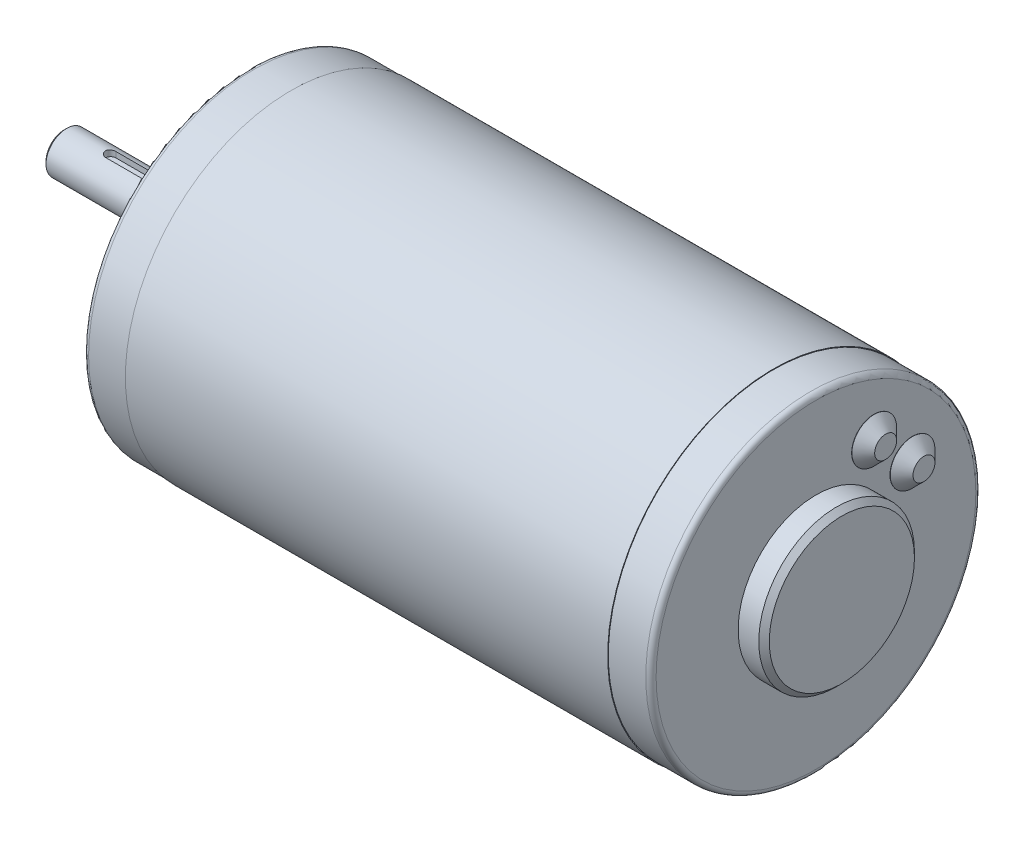
ISO-10303-21;
HEADER;
FILE_DESCRIPTION(('STEP AP214'),'2;1');
FILE_NAME('part.step','',(''),(''),'','','');
FILE_SCHEMA(('AUTOMOTIVE_DESIGN { 1 0 10303 214 1 1 1 1 }'));
ENDSEC;
DATA;
#1=APPLICATION_CONTEXT('core data for automotive mechanical design processes');
#2=APPLICATION_PROTOCOL_DEFINITION('international standard','automotive_design',2000,#1);
#3=PRODUCT_CONTEXT('',#1,'mechanical');
#4=PRODUCT('Part','Part','',(#3));
#5=PRODUCT_RELATED_PRODUCT_CATEGORY('part','',(#4));
#6=PRODUCT_DEFINITION_FORMATION('','',#4);
#7=PRODUCT_DEFINITION_CONTEXT('part definition',#1,'design');
#8=PRODUCT_DEFINITION('design','',#6,#7);
#9=PRODUCT_DEFINITION_SHAPE('','',#8);
#10=(LENGTH_UNIT() NAMED_UNIT(*) SI_UNIT(.MILLI.,.METRE.));
#11=(NAMED_UNIT(*) PLANE_ANGLE_UNIT() SI_UNIT($,.RADIAN.));
#12=(NAMED_UNIT(*) SI_UNIT($,.STERADIAN.) SOLID_ANGLE_UNIT());
#13=UNCERTAINTY_MEASURE_WITH_UNIT(LENGTH_MEASURE(1.E-05),#10,'distance_accuracy_value','');
#14=(GEOMETRIC_REPRESENTATION_CONTEXT(3) GLOBAL_UNCERTAINTY_ASSIGNED_CONTEXT((#13)) GLOBAL_UNIT_ASSIGNED_CONTEXT((#10,
#11,#12)) REPRESENTATION_CONTEXT('',''));
#15=CARTESIAN_POINT('',(0.,0.,0.));
#16=DIRECTION('',(0.,0.,1.));
#17=DIRECTION('',(1.,0.,0.));
#18=AXIS2_PLACEMENT_3D('',#15,#16,#17);
#19=CARTESIAN_POINT('',(-4.,0.,0.));
#20=DIRECTION('',(-1.,0.,0.));
#21=DIRECTION('',(0.,0.,1.));
#22=AXIS2_PLACEMENT_3D('',#19,#20,#21);
#23=PLANE('',#22);
#24=CARTESIAN_POINT('',(-4.,0.,0.));
#25=DIRECTION('',(-1.,0.,0.));
#26=DIRECTION('',(0.,0.,1.));
#27=AXIS2_PLACEMENT_3D('',#24,#25,#26);
#28=CIRCLE('',#27,8.50900000000004);
#29=CARTESIAN_POINT('',(-4.,0.,8.50900000000004));
#30=VERTEX_POINT('',#29);
#31=EDGE_CURVE('E164',#30,#30,#28,.T.);
#32=ORIENTED_EDGE('',*,*,#31,.T.);
#33=EDGE_LOOP('',(#32));
#34=FACE_BOUND('',#33,.T.);
#35=CARTESIAN_POINT('',(-4.,0.,0.));
#36=DIRECTION('',(-1.,0.,0.));
#37=DIRECTION('',(0.,0.,1.));
#38=AXIS2_PLACEMENT_3D('',#35,#36,#37);
#39=CIRCLE('',#38,4.);
#40=CARTESIAN_POINT('',(-4.,0.,4.));
#41=VERTEX_POINT('',#40);
#42=EDGE_CURVE('E131',#41,#41,#39,.T.);
#43=ORIENTED_EDGE('',*,*,#42,.F.);
#44=EDGE_LOOP('',(#43));
#45=FACE_BOUND('',#44,.T.);
#46=ADVANCED_FACE('F34',(#34,#45),#23,.T.);
#47=CARTESIAN_POINT('',(0.,0.,0.));
#48=DIRECTION('',(-1.,0.,0.));
#49=DIRECTION('',(0.,0.,1.));
#50=AXIS2_PLACEMENT_3D('',#47,#48,#49);
#51=PLANE('',#50);
#52=CARTESIAN_POINT('',(0.,0.,0.));
#53=DIRECTION('',(-1.,0.,0.));
#54=DIRECTION('',(0.,0.,1.));
#55=AXIS2_PLACEMENT_3D('',#52,#53,#54);
#56=CIRCLE('',#55,30.877);
#57=CARTESIAN_POINT('',(0.,0.,30.877));
#58=VERTEX_POINT('',#57);
#59=EDGE_CURVE('E182',#58,#58,#56,.T.);
#60=ORIENTED_EDGE('',*,*,#59,.T.);
#61=EDGE_LOOP('',(#60));
#62=FACE_BOUND('',#61,.T.);
#63=CARTESIAN_POINT('',(0.,25.4,0.));
#64=DIRECTION('',(-1.,0.,0.));
#65=DIRECTION('',(0.,0.,1.));
#66=AXIS2_PLACEMENT_3D('',#63,#64,#65);
#67=CIRCLE('',#66,2.01929999999999);
#68=CARTESIAN_POINT('',(0.,25.4,2.01929999999999));
#69=VERTEX_POINT('',#68);
#70=EDGE_CURVE('E104',#69,#69,#67,.T.);
#71=ORIENTED_EDGE('',*,*,#70,.F.);
#72=EDGE_LOOP('',(#71));
#73=FACE_BOUND('',#72,.T.);
#74=CARTESIAN_POINT('',(0.,-25.4,0.));
#75=DIRECTION('',(-1.,0.,0.));
#76=DIRECTION('',(0.,0.,1.));
#77=AXIS2_PLACEMENT_3D('',#74,#75,#76);
#78=CIRCLE('',#77,2.01929999999999);
#79=CARTESIAN_POINT('',(0.,-25.4,2.01929999999999));
#80=VERTEX_POINT('',#79);
#81=EDGE_CURVE('E113',#80,#80,#78,.T.);
#82=ORIENTED_EDGE('',*,*,#81,.F.);
#83=EDGE_LOOP('',(#82));
#84=FACE_BOUND('',#83,.T.);
#85=CARTESIAN_POINT('',(0.,0.,0.));
#86=DIRECTION('',(-1.,0.,0.));
#87=DIRECTION('',(0.,0.,1.));
#88=AXIS2_PLACEMENT_3D('',#85,#86,#87);
#89=CIRCLE('',#88,9.525);
#90=CARTESIAN_POINT('',(0.,0.,9.525));
#91=VERTEX_POINT('',#90);
#92=EDGE_CURVE('E134',#91,#91,#89,.T.);
#93=ORIENTED_EDGE('',*,*,#92,.F.);
#94=EDGE_LOOP('',(#93));
#95=FACE_BOUND('',#94,.T.);
#96=ADVANCED_FACE('F256',(#62,#73,#84,#95),#51,.T.);
#97=CARTESIAN_POINT('',(8.2296,32.004,0.));
#98=DIRECTION('',(-1.,0.,0.));
#99=DIRECTION('',(0.,0.,1.));
#100=AXIS2_PLACEMENT_3D('',#97,#98,#99);
#101=PLANE('',#100);
#102=CARTESIAN_POINT('',(8.2296,0.,0.));
#103=DIRECTION('',(1.,0.,0.));
#104=DIRECTION('',(0.,0.,-1.));
#105=AXIS2_PLACEMENT_3D('',#102,#103,#104);
#106=CIRCLE('',#105,32.004);
#107=CARTESIAN_POINT('',(8.2296,0.,-32.004));
#108=VERTEX_POINT('',#107);
#109=EDGE_CURVE('E155',#108,#108,#106,.T.);
#110=ORIENTED_EDGE('',*,*,#109,.F.);
#111=EDGE_LOOP('',(#110));
#112=FACE_BOUND('',#111,.T.);
#113=CARTESIAN_POINT('',(8.2296,0.,0.));
#114=DIRECTION('',(-1.,0.,0.));
#115=DIRECTION('',(0.,0.,1.));
#116=AXIS2_PLACEMENT_3D('',#113,#114,#115);
#117=CIRCLE('',#116,31.877);
#118=CARTESIAN_POINT('',(8.2296,0.,31.877));
#119=VERTEX_POINT('',#118);
#120=EDGE_CURVE('E137',#119,#119,#117,.T.);
#121=ORIENTED_EDGE('',*,*,#120,.F.);
#122=EDGE_LOOP('',(#121));
#123=FACE_BOUND('',#122,.T.);
#124=ADVANCED_FACE('F261',(#112,#123),#101,.T.);
#125=CARTESIAN_POINT('',(109.6,0.,0.));
#126=DIRECTION('',(1.,0.,0.));
#127=DIRECTION('',(0.,0.,-1.));
#128=AXIS2_PLACEMENT_3D('',#125,#126,#127);
#129=PLANE('',#128);
#130=CARTESIAN_POINT('',(109.6,0.,0.));
#131=DIRECTION('',(1.,0.,0.));
#132=DIRECTION('',(0.,0.,-1.));
#133=AXIS2_PLACEMENT_3D('',#130,#131,#132);
#134=CIRCLE('',#133,30.877);
#135=CARTESIAN_POINT('',(109.6,0.,-30.877));
#136=VERTEX_POINT('',#135);
#137=EDGE_CURVE('E176',#136,#136,#134,.T.);
#138=ORIENTED_EDGE('',*,*,#137,.T.);
#139=EDGE_LOOP('',(#138));
#140=FACE_BOUND('',#139,.T.);
#141=CARTESIAN_POINT('',(109.6,18.6070906828553,-11.2073596390943));
#142=DIRECTION('',(1.,0.,0.));
#143=DIRECTION('',(0.,0.,-1.));
#144=AXIS2_PLACEMENT_3D('',#141,#142,#143);
#145=CIRCLE('',#144,4.318);
#146=CARTESIAN_POINT('',(109.6,18.6070906828553,-15.5253596390943));
#147=VERTEX_POINT('',#146);
#148=EDGE_CURVE('E161',#147,#147,#145,.T.);
#149=ORIENTED_EDGE('',*,*,#148,.F.);
#150=EDGE_LOOP('',(#149));
#151=FACE_BOUND('',#150,.T.);
#152=CARTESIAN_POINT('',(109.6,11.2073596390943,-18.6070906828553));
#153=DIRECTION('',(1.,0.,0.));
#154=DIRECTION('',(0.,0.,-1.));
#155=AXIS2_PLACEMENT_3D('',#152,#153,#154);
#156=CIRCLE('',#155,4.318);
#157=CARTESIAN_POINT('',(109.6,11.2073596390943,-22.9250906828553));
#158=VERTEX_POINT('',#157);
#159=EDGE_CURVE('E158',#158,#158,#156,.T.);
#160=ORIENTED_EDGE('',*,*,#159,.F.);
#161=EDGE_LOOP('',(#160));
#162=FACE_BOUND('',#161,.T.);
#163=CARTESIAN_POINT('',(109.6,0.,0.));
#164=DIRECTION('',(1.,0.,0.));
#165=DIRECTION('',(0.,0.,-1.));
#166=AXIS2_PLACEMENT_3D('',#163,#164,#165);
#167=CIRCLE('',#166,15.0368);
#168=CARTESIAN_POINT('',(109.6,0.,-15.0368));
#169=VERTEX_POINT('',#168);
#170=EDGE_CURVE('E143',#169,#169,#167,.T.);
#171=ORIENTED_EDGE('',*,*,#170,.F.);
#172=EDGE_LOOP('',(#171));
#173=FACE_BOUND('',#172,.T.);
#174=ADVANCED_FACE('F286',(#140,#151,#162,#173),#129,.T.);
#175=CARTESIAN_POINT('',(101.3704,0.,0.));
#176=DIRECTION('',(1.,0.,0.));
#177=DIRECTION('',(0.,0.,-1.));
#178=AXIS2_PLACEMENT_3D('',#175,#176,#177);
#179=PLANE('',#178);
#180=CARTESIAN_POINT('',(101.3704,0.,0.));
#181=DIRECTION('',(1.,0.,0.));
#182=DIRECTION('',(0.,0.,-1.));
#183=AXIS2_PLACEMENT_3D('',#180,#181,#182);
#184=CIRCLE('',#183,32.004);
#185=CARTESIAN_POINT('',(101.3704,0.,-32.004));
#186=VERTEX_POINT('',#185);
#187=EDGE_CURVE('E152',#186,#186,#184,.T.);
#188=ORIENTED_EDGE('',*,*,#187,.T.);
#189=EDGE_LOOP('',(#188));
#190=FACE_BOUND('',#189,.T.);
#191=CARTESIAN_POINT('',(101.3704,0.,0.));
#192=DIRECTION('',(1.,0.,0.));
#193=DIRECTION('',(0.,0.,-1.));
#194=AXIS2_PLACEMENT_3D('',#191,#192,#193);
#195=CIRCLE('',#194,31.877);
#196=CARTESIAN_POINT('',(101.3704,0.,-31.877));
#197=VERTEX_POINT('',#196);
#198=EDGE_CURVE('E147',#197,#197,#195,.T.);
#199=ORIENTED_EDGE('',*,*,#198,.F.);
#200=EDGE_LOOP('',(#199));
#201=FACE_BOUND('',#200,.T.);
#202=ADVANCED_FACE('F289',(#190,#201),#179,.T.);
#203=CARTESIAN_POINT('',(8.2296,0.,0.));
#204=DIRECTION('',(1.,0.,0.));
#205=DIRECTION('',(0.,0.,-1.));
#206=AXIS2_PLACEMENT_3D('',#203,#204,#205);
#207=CYLINDRICAL_SURFACE('',#206,32.004);
#208=ORIENTED_EDGE('',*,*,#109,.T.);
#209=EDGE_LOOP('',(#208));
#210=FACE_BOUND('',#209,.T.);
#211=ORIENTED_EDGE('',*,*,#187,.F.);
#212=EDGE_LOOP('',(#211));
#213=FACE_BOUND('',#212,.T.);
#214=ADVANCED_FACE('F293',(#210,#213),#207,.T.);
#215=CARTESIAN_POINT('',(109.6,0.,0.));
#216=DIRECTION('',(-1.,0.,0.));
#217=DIRECTION('',(0.,0.,1.));
#218=AXIS2_PLACEMENT_3D('',#215,#216,#217);
#219=CYLINDRICAL_SURFACE('',#218,31.877);
#220=CARTESIAN_POINT('',(108.6,0.,0.));
#221=DIRECTION('',(1.,0.,0.));
#222=DIRECTION('',(0.,0.,-1.));
#223=AXIS2_PLACEMENT_3D('',#220,#221,#222);
#224=CIRCLE('',#223,31.877);
#225=CARTESIAN_POINT('',(108.6,0.,-31.877));
#226=VERTEX_POINT('',#225);
#227=EDGE_CURVE('E179',#226,#226,#224,.F.);
#228=ORIENTED_EDGE('',*,*,#227,.T.);
#229=EDGE_LOOP('',(#228));
#230=FACE_BOUND('',#229,.T.);
#231=ORIENTED_EDGE('',*,*,#198,.T.);
#232=EDGE_LOOP('',(#231));
#233=FACE_BOUND('',#232,.T.);
#234=ADVANCED_FACE('F284',(#230,#233),#219,.T.);
#235=CARTESIAN_POINT('',(113.584,0.,0.));
#236=DIRECTION('',(-1.,0.,0.));
#237=DIRECTION('',(0.,0.,1.));
#238=AXIS2_PLACEMENT_3D('',#235,#236,#237);
#239=CYLINDRICAL_SURFACE('',#238,15.0368);
#240=CARTESIAN_POINT('',(113.584,0.,0.));
#241=DIRECTION('',(1.,0.,0.));
#242=DIRECTION('',(0.,0.,-1.));
#243=AXIS2_PLACEMENT_3D('',#240,#241,#242);
#244=CIRCLE('',#243,15.0368);
#245=CARTESIAN_POINT('',(113.584,0.,-15.0368));
#246=VERTEX_POINT('',#245);
#247=EDGE_CURVE('E144',#246,#246,#244,.T.);
#248=ORIENTED_EDGE('',*,*,#247,.F.);
#249=EDGE_LOOP('',(#248));
#250=FACE_BOUND('',#249,.T.);
#251=ORIENTED_EDGE('',*,*,#170,.T.);
#252=EDGE_LOOP('',(#251));
#253=FACE_BOUND('',#252,.T.);
#254=ADVANCED_FACE('F280',(#250,#253),#239,.T.);
#255=CARTESIAN_POINT('',(113.584,0.,0.));
#256=DIRECTION('',(-1.,0.,0.));
#257=DIRECTION('',(0.,0.,-1.));
#258=AXIS2_PLACEMENT_3D('',#255,#256,#257);
#259=CONICAL_SURFACE('',#258,15.0368,0.785398163397437);
#260=CARTESIAN_POINT('',(114.6,0.,0.));
#261=DIRECTION('',(1.,0.,0.));
#262=DIRECTION('',(0.,0.,-1.));
#263=AXIS2_PLACEMENT_3D('',#260,#261,#262);
#264=CIRCLE('',#263,14.0208);
#265=CARTESIAN_POINT('',(114.6,0.,-14.0208));
#266=VERTEX_POINT('',#265);
#267=EDGE_CURVE('E140',#266,#266,#264,.T.);
#268=ORIENTED_EDGE('',*,*,#267,.F.);
#269=EDGE_LOOP('',(#268));
#270=FACE_BOUND('',#269,.T.);
#271=ORIENTED_EDGE('',*,*,#247,.T.);
#272=EDGE_LOOP('',(#271));
#273=FACE_BOUND('',#272,.T.);
#274=ADVANCED_FACE('F276',(#270,#273),#259,.T.);
#275=CARTESIAN_POINT('',(114.6,0.,0.));
#276=DIRECTION('',(1.,0.,0.));
#277=DIRECTION('',(0.,0.,-1.));
#278=AXIS2_PLACEMENT_3D('',#275,#276,#277);
#279=PLANE('',#278);
#280=ORIENTED_EDGE('',*,*,#267,.T.);
#281=EDGE_LOOP('',(#280));
#282=FACE_BOUND('',#281,.T.);
#283=ADVANCED_FACE('F272',(#282),#279,.T.);
#284=CARTESIAN_POINT('',(0.,0.,0.));
#285=DIRECTION('',(1.,0.,0.));
#286=DIRECTION('',(0.,0.,-1.));
#287=AXIS2_PLACEMENT_3D('',#284,#285,#286);
#288=CYLINDRICAL_SURFACE('',#287,31.877);
#289=CARTESIAN_POINT('',(0.999999999999998,0.,0.));
#290=DIRECTION('',(-1.,0.,0.));
#291=DIRECTION('',(0.,0.,1.));
#292=AXIS2_PLACEMENT_3D('',#289,#290,#291);
#293=CIRCLE('',#292,31.877);
#294=CARTESIAN_POINT('',(0.999999999999998,0.,31.877));
#295=VERTEX_POINT('',#294);
#296=EDGE_CURVE('E185',#295,#295,#293,.F.);
#297=ORIENTED_EDGE('',*,*,#296,.T.);
#298=EDGE_LOOP('',(#297));
#299=FACE_BOUND('',#298,.T.);
#300=ORIENTED_EDGE('',*,*,#120,.T.);
#301=EDGE_LOOP('',(#300));
#302=FACE_BOUND('',#301,.T.);
#303=ADVANCED_FACE('F267',(#299,#302),#288,.T.);
#304=CARTESIAN_POINT('',(-4.,0.,0.));
#305=DIRECTION('',(1.,0.,0.));
#306=DIRECTION('',(0.,0.,-1.));
#307=AXIS2_PLACEMENT_3D('',#304,#305,#306);
#308=CYLINDRICAL_SURFACE('',#307,9.525);
#309=CARTESIAN_POINT('',(-2.98400000000005,0.,0.));
#310=DIRECTION('',(-1.,0.,0.));
#311=DIRECTION('',(0.,0.,1.));
#312=AXIS2_PLACEMENT_3D('',#309,#310,#311);
#313=CIRCLE('',#312,9.525);
#314=CARTESIAN_POINT('',(-2.98400000000005,0.,9.525));
#315=VERTEX_POINT('',#314);
#316=EDGE_CURVE('E167',#315,#315,#313,.F.);
#317=ORIENTED_EDGE('',*,*,#316,.T.);
#318=EDGE_LOOP('',(#317));
#319=FACE_BOUND('',#318,.T.);
#320=ORIENTED_EDGE('',*,*,#92,.T.);
#321=EDGE_LOOP('',(#320));
#322=FACE_BOUND('',#321,.T.);
#323=ADVANCED_FACE('F253',(#319,#322),#308,.T.);
#324=CARTESIAN_POINT('',(-35.6,0.,0.));
#325=DIRECTION('',(1.,0.,0.));
#326=DIRECTION('',(0.,0.,-1.));
#327=AXIS2_PLACEMENT_3D('',#324,#325,#326);
#328=CYLINDRICAL_SURFACE('',#327,4.);
#329=CARTESIAN_POINT('',(-26.6,3.87298334620741,1.));
#330=CARTESIAN_POINT('',(-26.6276629851065,3.87298148580177,1.00000033749611));
#331=CARTESIAN_POINT('',(-26.6553122630182,3.8732800994947,0.998851407375366));
#332=CARTESIAN_POINT('',(-26.7104040353036,3.87445904774558,0.994271295395754));
#333=CARTESIAN_POINT('',(-26.7378465636871,3.87533928441687,0.990840497572679));
#334=CARTESIAN_POINT('',(-26.8194531732088,3.87881710972053,0.977175239382526));
#335=CARTESIAN_POINT('',(-26.8730564684822,3.88225203148808,0.963567695172493));
#336=CARTESIAN_POINT('',(-26.977124673782,3.89095422588002,0.927798076247996));
#337=CARTESIAN_POINT('',(-27.0275898782129,3.89622132630929,0.905636805423834));
#338=CARTESIAN_POINT('',(-27.1241114486473,3.90799134471939,0.853415378025864));
#339=CARTESIAN_POINT('',(-27.170166627891,3.91449459395647,0.823353103356932));
#340=CARTESIAN_POINT('',(-27.2575438819061,3.92816262398025,0.755484471828068));
#341=CARTESIAN_POINT('',(-27.2987548862455,3.93533791028915,0.717537268783974));
#342=CARTESIAN_POINT('',(-27.3743020894827,3.94945104396193,0.635275780516227));
#343=CARTESIAN_POINT('',(-27.4086371894679,3.95638885322537,0.590960479478829));
#344=CARTESIAN_POINT('',(-27.4699110016186,3.96936182283248,0.496456899401689));
#345=CARTESIAN_POINT('',(-27.496739895984,3.9753830468173,0.446195340334472));
#346=CARTESIAN_POINT('',(-27.5415247341967,3.98572346250588,0.341702590842918));
#347=CARTESIAN_POINT('',(-27.5594824242998,3.990042989147,0.28747218408301));
#348=CARTESIAN_POINT('',(-27.5856589927774,3.99641900005128,0.177744108525161));
#349=CARTESIAN_POINT('',(-27.5940676724228,3.998519529013,0.122294322002858));
#350=CARTESIAN_POINT('',(-27.6015033715433,4.00037438150815,0.010732775681679));
#351=CARTESIAN_POINT('',(-27.6005315701923,4.00012899993444,-0.0453789000287063));
#352=CARTESIAN_POINT('',(-27.5893700363146,3.99735237365735,-0.155352492972097));
#353=CARTESIAN_POINT('',(-27.5793853834005,3.9948719867736,-0.209236701739855));
#354=CARTESIAN_POINT('',(-27.5508113208173,3.98796330636495,-0.31453871108434));
#355=CARTESIAN_POINT('',(-27.5322215304314,3.98353492665556,-0.365956402423988));
#356=CARTESIAN_POINT('',(-27.4867987193294,3.97314997761798,-0.465407286024539));
#357=CARTESIAN_POINT('',(-27.4598926057672,3.96717993827555,-0.513405629602248));
#358=CARTESIAN_POINT('',(-27.3986568701665,3.95435945541919,-0.604276631230014));
#359=CARTESIAN_POINT('',(-27.3643261297468,3.94750887933198,-0.64714851556229));
#360=CARTESIAN_POINT('',(-27.2881210879187,3.93345566022865,-0.727769389708491));
#361=CARTESIAN_POINT('',(-27.2460683634602,3.92624850477685,-0.765349103054127));
#362=CARTESIAN_POINT('',(-27.1561701330723,3.91246168284006,-0.832969575186237));
#363=CARTESIAN_POINT('',(-27.1083230467164,3.90588218842993,-0.863008270245061));
#364=CARTESIAN_POINT('',(-27.0078544021762,3.89407813586325,-0.914804709285961));
#365=CARTESIAN_POINT('',(-26.9552085351039,3.88886106009136,-0.936517017887268));
#366=CARTESIAN_POINT('',(-26.8468830715817,3.88047058807054,-0.970702351849828));
#367=CARTESIAN_POINT('',(-26.7912081448502,3.87729413761435,-0.983189189212131));
#368=CARTESIAN_POINT('',(-26.7125426192411,3.87455290681524,-0.993904635150938));
#369=CARTESIAN_POINT('',(-26.6900802967868,3.87396523110859,-0.996190790966708));
#370=CARTESIAN_POINT('',(-26.6450822100907,3.87318062488974,-0.999236757697393));
#371=CARTESIAN_POINT('',(-26.6225466240447,3.87298306219461,-0.999999038096045));
#372=CARTESIAN_POINT('',(-26.6,3.87298334620741,-1.));
#373=B_SPLINE_CURVE_WITH_KNOTS('',3,(#329,#330,#331,#332,#333,#334,#335,#336,#337,#338,#339,
#340,#341,#342,#343,#344,#345,#346,#347,#348,#349,#350,#351,#352,#353,#354,#355,#356,#357,#358,
#359,#360,#361,#362,#363,#364,#365,#366,#367,#368,#369,#370,#371,#372),.UNSPECIFIED.,.F.,.F.,(4,
2,2,2,2,2,2,2,2,2,2,2,2,2,2,2,2,2,2,2,2,4),(0.,0.0829365303397727,0.165859106084653,
0.331229963080318,0.496585282091499,0.661984974726751,0.830641897427977,0.999325753539196,
1.17036187098235,1.34136430732424,1.50890481515325,1.67642426256639,1.84022545479276,
2.00403389475838,2.16932509450376,2.33464120964329,2.50441429534542,2.67423379180967,
2.84496720161067,3.01544447539986,3.08315848722648,3.15076267731671),.UNSPECIFIED.);
#374=CARTESIAN_POINT('',(-26.6,3.87298334620741,1.));
#375=VERTEX_POINT('',#374);
#376=CARTESIAN_POINT('',(-26.6,3.87298334620741,-1.));
#377=VERTEX_POINT('',#376);
#378=EDGE_CURVE('E42',#375,#377,#373,.T.);
#379=ORIENTED_EDGE('',*,*,#378,.T.);
#380=DIRECTION('',(1.,0.,0.));
#381=VECTOR('',#380,1.);
#382=CARTESIAN_POINT('',(-35.6,3.87298334620741,-1.));
#383=LINE('',#382,#381);
#384=CARTESIAN_POINT('',(-7.1,3.87298334620741,-1.));
#385=VERTEX_POINT('',#384);
#386=EDGE_CURVE('E11',#377,#385,#383,.T.);
#387=ORIENTED_EDGE('',*,*,#386,.T.);
#388=CARTESIAN_POINT('',(-7.1,3.87298334620741,-1.));
#389=CARTESIAN_POINT('',(-7.07233701489346,3.87298148580177,-1.00000033749611));
#390=CARTESIAN_POINT('',(-7.04468773698177,3.8732800994947,-0.998851407375366));
#391=CARTESIAN_POINT('',(-6.98959596469644,3.87445904774558,-0.994271295395754));
#392=CARTESIAN_POINT('',(-6.96215343631291,3.87533928441687,-0.990840497572679));
#393=CARTESIAN_POINT('',(-6.88054682679116,3.87881710972053,-0.977175239382526));
#394=CARTESIAN_POINT('',(-6.82694353151779,3.88225203148808,-0.963567695172493));
#395=CARTESIAN_POINT('',(-6.72287532621804,3.89095422588002,-0.927798076247997));
#396=CARTESIAN_POINT('',(-6.67241012178714,3.89622132630929,-0.905636805423835));
#397=CARTESIAN_POINT('',(-6.57588855135267,3.90799134471939,-0.853415378025865));
#398=CARTESIAN_POINT('',(-6.52983337210904,3.91449459395647,-0.823353103356932));
#399=CARTESIAN_POINT('',(-6.4424561180939,3.92816262398025,-0.755484471828069));
#400=CARTESIAN_POINT('',(-6.40124511375448,3.93533791028915,-0.717537268783976));
#401=CARTESIAN_POINT('',(-6.32569791051729,3.94945104396193,-0.63527578051623));
#402=CARTESIAN_POINT('',(-6.29136281053206,3.95638885322537,-0.590960479478831));
#403=CARTESIAN_POINT('',(-6.23008899838136,3.96936182283248,-0.49645689940169));
#404=CARTESIAN_POINT('',(-6.20326010401603,3.9753830468173,-0.446195340334474));
#405=CARTESIAN_POINT('',(-6.1584752658033,3.98572346250588,-0.341702590842919));
#406=CARTESIAN_POINT('',(-6.14051757570017,3.990042989147,-0.28747218408301));
#407=CARTESIAN_POINT('',(-6.11434100722257,3.99641900005128,-0.17774410852516));
#408=CARTESIAN_POINT('',(-6.10593232757718,3.998519529013,-0.122294322002858));
#409=CARTESIAN_POINT('',(-6.09849662845671,4.00037438150815,-0.0107327756816796));
#410=CARTESIAN_POINT('',(-6.09946842980766,4.00012899993444,0.0453789000287056));
#411=CARTESIAN_POINT('',(-6.11062996368545,3.99735237365735,0.155352492972096));
#412=CARTESIAN_POINT('',(-6.12061461659948,3.9948719867736,0.209236701739855));
#413=CARTESIAN_POINT('',(-6.14918867918275,3.98796330636495,0.31453871108434));
#414=CARTESIAN_POINT('',(-6.16777846956858,3.98353492665556,0.365956402423987));
#415=CARTESIAN_POINT('',(-6.21320128067065,3.97314997761798,0.465407286024539));
#416=CARTESIAN_POINT('',(-6.24010739423284,3.96717993827555,0.513405629602248));
#417=CARTESIAN_POINT('',(-6.30134312983347,3.95435945541919,0.604276631230014));
#418=CARTESIAN_POINT('',(-6.33567387025322,3.94750887933198,0.647148515562289));
#419=CARTESIAN_POINT('',(-6.41187891208131,3.93345566022865,0.72776938970849));
#420=CARTESIAN_POINT('',(-6.45393163653981,3.92624850477685,0.765349103054127));
#421=CARTESIAN_POINT('',(-6.54382986692773,3.91246168284006,0.832969575186237));
#422=CARTESIAN_POINT('',(-6.59167695328356,3.90588218842993,0.863008270245062));
#423=CARTESIAN_POINT('',(-6.69214559782377,3.89407813586325,0.914804709285961));
#424=CARTESIAN_POINT('',(-6.74479146489609,3.88886106009136,0.936517017887269));
#425=CARTESIAN_POINT('',(-6.85311692841829,3.88047058807055,0.970702351849828));
#426=CARTESIAN_POINT('',(-6.90879185514984,3.87729413761435,0.983189189212131));
#427=CARTESIAN_POINT('',(-6.9874573807589,3.87455290681524,0.993904635150937));
#428=CARTESIAN_POINT('',(-7.00991970321318,3.87396523110859,0.996190790966708));
#429=CARTESIAN_POINT('',(-7.05491778990932,3.87318062488974,0.999236757697393));
#430=CARTESIAN_POINT('',(-7.07745337595529,3.87298306219461,0.999999038096045));
#431=CARTESIAN_POINT('',(-7.1,3.87298334620741,1.));
#432=B_SPLINE_CURVE_WITH_KNOTS('',3,(#388,#389,#390,#391,#392,#393,#394,#395,#396,#397,#398,
#399,#400,#401,#402,#403,#404,#405,#406,#407,#408,#409,#410,#411,#412,#413,#414,#415,#416,#417,
#418,#419,#420,#421,#422,#423,#424,#425,#426,#427,#428,#429,#430,#431),.UNSPECIFIED.,.F.,.F.,(4,
2,2,2,2,2,2,2,2,2,2,2,2,2,2,2,2,2,2,2,2,4),(0.,0.0829365303397693,0.165859106084651,
0.331229963080317,0.496585282091499,0.66198497472675,0.830641897427974,0.999325753539193,
1.17036187098235,1.34136430732424,1.50890481515325,1.67642426256639,1.84022545479276,
2.00403389475838,2.16932509450376,2.33464120964329,2.50441429534542,2.67423379180967,
2.84496720161068,3.01544447539986,3.08315848722648,3.15076267731671),.UNSPECIFIED.);
#433=CARTESIAN_POINT('',(-7.1,3.87298334620741,1.));
#434=VERTEX_POINT('',#433);
#435=EDGE_CURVE('E81',#385,#434,#432,.T.);
#436=ORIENTED_EDGE('',*,*,#435,.T.);
#437=DIRECTION('',(1.,0.,0.));
#438=VECTOR('',#437,1.);
#439=CARTESIAN_POINT('',(-35.6,3.87298334620741,1.));
#440=LINE('',#439,#438);
#441=EDGE_CURVE('E194',#434,#375,#440,.F.);
#442=ORIENTED_EDGE('',*,*,#441,.T.);
#443=EDGE_LOOP('',(#379,#387,#436,#442));
#444=FACE_BOUND('',#443,.T.);
#445=CARTESIAN_POINT('',(-35.099999999993,0.,0.));
#446=DIRECTION('',(-1.,0.,0.));
#447=DIRECTION('',(0.,0.,1.));
#448=AXIS2_PLACEMENT_3D('',#445,#446,#447);
#449=CIRCLE('',#448,4.);
#450=CARTESIAN_POINT('',(-35.099999999993,0.,4.));
#451=VERTEX_POINT('',#450);
#452=EDGE_CURVE('E173',#451,#451,#449,.F.);
#453=ORIENTED_EDGE('',*,*,#452,.T.);
#454=EDGE_LOOP('',(#453));
#455=FACE_BOUND('',#454,.T.);
#456=ORIENTED_EDGE('',*,*,#42,.T.);
#457=EDGE_LOOP('',(#456));
#458=FACE_BOUND('',#457,.T.);
#459=ADVANCED_FACE('F195',(#444,#455,#458),#328,.T.);
#460=CARTESIAN_POINT('',(-35.6,0.,0.));
#461=DIRECTION('',(-1.,0.,0.));
#462=DIRECTION('',(0.,0.,1.));
#463=AXIS2_PLACEMENT_3D('',#460,#461,#462);
#464=PLANE('',#463);
#465=CARTESIAN_POINT('',(-35.6,0.,0.));
#466=DIRECTION('',(-1.,0.,0.));
#467=DIRECTION('',(0.,0.,1.));
#468=AXIS2_PLACEMENT_3D('',#465,#466,#467);
#469=CIRCLE('',#468,3.49999999993619);
#470=CARTESIAN_POINT('',(-35.6,0.,3.49999999993619));
#471=VERTEX_POINT('',#470);
#472=EDGE_CURVE('E170',#471,#471,#469,.T.);
#473=ORIENTED_EDGE('',*,*,#472,.T.);
#474=EDGE_LOOP('',(#473));
#475=FACE_BOUND('',#474,.T.);
#476=ADVANCED_FACE('F246',(#475),#464,.T.);
#477=CARTESIAN_POINT('',(109.6,11.2073596390943,-18.6070906828553));
#478=DIRECTION('',(1.,0.,0.));
#479=DIRECTION('',(0.,0.,-1.));
#480=AXIS2_PLACEMENT_3D('',#477,#478,#479);
#481=CYLINDRICAL_SURFACE('',#480,4.318);
#482=ORIENTED_EDGE('',*,*,#159,.T.);
#483=EDGE_LOOP('',(#482));
#484=FACE_BOUND('',#483,.T.);
#485=CARTESIAN_POINT('',(109.6479,11.2073596390943,-18.6070906828553));
#486=DIRECTION('',(1.,0.,0.));
#487=DIRECTION('',(0.,0.,-1.));
#488=AXIS2_PLACEMENT_3D('',#485,#486,#487);
#489=CIRCLE('',#488,4.318);
#490=CARTESIAN_POINT('',(109.6479,11.2073596390943,-22.9250906828553));
#491=VERTEX_POINT('',#490);
#492=EDGE_CURVE('E125',#491,#491,#489,.T.);
#493=ORIENTED_EDGE('',*,*,#492,.F.);
#494=EDGE_LOOP('',(#493));
#495=FACE_BOUND('',#494,.T.);
#496=ADVANCED_FACE('F243',(#484,#495),#481,.T.);
#497=CARTESIAN_POINT('',(111.847899999964,11.2073596390943,-18.6070906828553));
#498=DIRECTION('',(1.,0.,0.));
#499=DIRECTION('',(0.,0.,-1.));
#500=AXIS2_PLACEMENT_3D('',#497,#498,#499);
#501=PLANE('',#500);
#502=CARTESIAN_POINT('',(111.847899999964,11.2073596390943,-18.6070906828553));
#503=DIRECTION('',(1.,0.,0.));
#504=DIRECTION('',(0.,0.,-1.));
#505=AXIS2_PLACEMENT_3D('',#502,#503,#504);
#506=CIRCLE('',#505,2.11800000003618);
#507=CARTESIAN_POINT('',(111.847899999964,11.2073596390943,-20.7250906828915));
#508=VERTEX_POINT('',#507);
#509=EDGE_CURVE('E128',#508,#508,#506,.T.);
#510=ORIENTED_EDGE('',*,*,#509,.T.);
#511=EDGE_LOOP('',(#510));
#512=FACE_BOUND('',#511,.T.);
#513=ADVANCED_FACE('F239',(#512),#501,.T.);
#514=CARTESIAN_POINT('',(111.847899999964,11.2073596390943,-18.6070906828553));
#515=DIRECTION('',(-1.,0.,0.));
#516=DIRECTION('',(0.,0.,1.));
#517=AXIS2_PLACEMENT_3D('',#514,#515,#516);
#518=CONICAL_SURFACE('',#517,2.11800000003618,0.78539816339745);
#519=ORIENTED_EDGE('',*,*,#492,.T.);
#520=EDGE_LOOP('',(#519));
#521=FACE_BOUND('',#520,.T.);
#522=ORIENTED_EDGE('',*,*,#509,.F.);
#523=EDGE_LOOP('',(#522));
#524=FACE_BOUND('',#523,.T.);
#525=ADVANCED_FACE('F235',(#521,#524),#518,.T.);
#526=CARTESIAN_POINT('',(109.6,18.6070906828553,-11.2073596390943));
#527=DIRECTION('',(1.,0.,0.));
#528=DIRECTION('',(0.,0.,-1.));
#529=AXIS2_PLACEMENT_3D('',#526,#527,#528);
#530=CYLINDRICAL_SURFACE('',#529,4.318);
#531=ORIENTED_EDGE('',*,*,#148,.T.);
#532=EDGE_LOOP('',(#531));
#533=FACE_BOUND('',#532,.T.);
#534=CARTESIAN_POINT('',(109.6479,18.6070906828553,-11.2073596390943));
#535=DIRECTION('',(1.,0.,0.));
#536=DIRECTION('',(0.,0.,-1.));
#537=AXIS2_PLACEMENT_3D('',#534,#535,#536);
#538=CIRCLE('',#537,4.318);
#539=CARTESIAN_POINT('',(109.6479,18.6070906828553,-15.5253596390943));
#540=VERTEX_POINT('',#539);
#541=EDGE_CURVE('E119',#540,#540,#538,.T.);
#542=ORIENTED_EDGE('',*,*,#541,.F.);
#543=EDGE_LOOP('',(#542));
#544=FACE_BOUND('',#543,.T.);
#545=ADVANCED_FACE('F231',(#533,#544),#530,.T.);
#546=CARTESIAN_POINT('',(111.847899999949,18.6070906828553,-11.2073596390943));
#547=DIRECTION('',(1.,0.,0.));
#548=DIRECTION('',(0.,0.,-1.));
#549=AXIS2_PLACEMENT_3D('',#546,#547,#548);
#550=PLANE('',#549);
#551=CARTESIAN_POINT('',(111.847899999949,18.6070906828553,-11.2073596390943));
#552=DIRECTION('',(1.,0.,0.));
#553=DIRECTION('',(0.,0.,-1.));
#554=AXIS2_PLACEMENT_3D('',#551,#552,#553);
#555=CIRCLE('',#554,2.11800000005086);
#556=CARTESIAN_POINT('',(111.847899999949,18.6070906828553,-13.3253596391452));
#557=VERTEX_POINT('',#556);
#558=EDGE_CURVE('E122',#557,#557,#555,.T.);
#559=ORIENTED_EDGE('',*,*,#558,.T.);
#560=EDGE_LOOP('',(#559));
#561=FACE_BOUND('',#560,.T.);
#562=ADVANCED_FACE('F227',(#561),#550,.T.);
#563=CARTESIAN_POINT('',(111.847899999949,18.6070906828553,-11.2073596390943));
#564=DIRECTION('',(-1.,0.,0.));
#565=DIRECTION('',(0.,0.,1.));
#566=AXIS2_PLACEMENT_3D('',#563,#564,#565);
#567=CONICAL_SURFACE('',#566,2.11800000005086,0.785398163397448);
#568=ORIENTED_EDGE('',*,*,#541,.T.);
#569=EDGE_LOOP('',(#568));
#570=FACE_BOUND('',#569,.T.);
#571=ORIENTED_EDGE('',*,*,#558,.F.);
#572=EDGE_LOOP('',(#571));
#573=FACE_BOUND('',#572,.T.);
#574=ADVANCED_FACE('F224',(#570,#573),#567,.T.);
#575=CARTESIAN_POINT('',(13.6144,-25.4,0.));
#576=DIRECTION('',(-1.,0.,0.));
#577=DIRECTION('',(0.,0.,1.));
#578=AXIS2_PLACEMENT_3D('',#575,#576,#577);
#579=CONICAL_SURFACE('',#578,2.01929999999999,1.02974425867198);
#580=CARTESIAN_POINT('',(14.8277178480152,-25.4,0.));
#581=VERTEX_POINT('',#580);
#582=VERTEX_LOOP('',#581);
#583=FACE_BOUND('',#582,.T.);
#584=CARTESIAN_POINT('',(13.6144,-25.4,0.));
#585=DIRECTION('',(-1.,0.,0.));
#586=DIRECTION('',(0.,0.,1.));
#587=AXIS2_PLACEMENT_3D('',#584,#585,#586);
#588=CIRCLE('',#587,2.01929999999999);
#589=CARTESIAN_POINT('',(13.6144,-25.4,2.01929999999999));
#590=VERTEX_POINT('',#589);
#591=EDGE_CURVE('E116',#590,#590,#588,.T.);
#592=ORIENTED_EDGE('',*,*,#591,.T.);
#593=EDGE_LOOP('',(#592));
#594=FACE_BOUND('',#593,.T.);
#595=ADVANCED_FACE('F220',(#583,#594),#579,.F.);
#596=CARTESIAN_POINT('',(0.,-25.4,0.));
#597=DIRECTION('',(-1.,0.,0.));
#598=DIRECTION('',(0.,0.,1.));
#599=AXIS2_PLACEMENT_3D('',#596,#597,#598);
#600=CYLINDRICAL_SURFACE('',#599,2.01929999999999);
#601=ORIENTED_EDGE('',*,*,#591,.F.);
#602=EDGE_LOOP('',(#601));
#603=FACE_BOUND('',#602,.T.);
#604=ORIENTED_EDGE('',*,*,#81,.T.);
#605=EDGE_LOOP('',(#604));
#606=FACE_BOUND('',#605,.T.);
#607=ADVANCED_FACE('F216',(#603,#606),#600,.F.);
#608=CARTESIAN_POINT('',(13.6144,25.4,0.));
#609=DIRECTION('',(-1.,0.,0.));
#610=DIRECTION('',(0.,0.,1.));
#611=AXIS2_PLACEMENT_3D('',#608,#609,#610);
#612=CONICAL_SURFACE('',#611,2.01929999999999,1.02974425867198);
#613=CARTESIAN_POINT('',(14.8277178480152,25.4,0.));
#614=VERTEX_POINT('',#613);
#615=VERTEX_LOOP('',#614);
#616=FACE_BOUND('',#615,.T.);
#617=CARTESIAN_POINT('',(13.6144,25.4,0.));
#618=DIRECTION('',(-1.,0.,0.));
#619=DIRECTION('',(0.,0.,1.));
#620=AXIS2_PLACEMENT_3D('',#617,#618,#619);
#621=CIRCLE('',#620,2.01929999999999);
#622=CARTESIAN_POINT('',(13.6144,25.4,2.01929999999999));
#623=VERTEX_POINT('',#622);
#624=EDGE_CURVE('E110',#623,#623,#621,.T.);
#625=ORIENTED_EDGE('',*,*,#624,.T.);
#626=EDGE_LOOP('',(#625));
#627=FACE_BOUND('',#626,.T.);
#628=ADVANCED_FACE('F212',(#616,#627),#612,.F.);
#629=CARTESIAN_POINT('',(0.,25.4,0.));
#630=DIRECTION('',(-1.,0.,0.));
#631=DIRECTION('',(0.,0.,1.));
#632=AXIS2_PLACEMENT_3D('',#629,#630,#631);
#633=CYLINDRICAL_SURFACE('',#632,2.01929999999999);
#634=ORIENTED_EDGE('',*,*,#624,.F.);
#635=EDGE_LOOP('',(#634));
#636=FACE_BOUND('',#635,.T.);
#637=ORIENTED_EDGE('',*,*,#70,.T.);
#638=EDGE_LOOP('',(#637));
#639=FACE_BOUND('',#638,.T.);
#640=ADVANCED_FACE('F208',(#636,#639),#633,.F.);
#641=CARTESIAN_POINT('',(-4.,0.,0.));
#642=DIRECTION('',(1.,0.,0.));
#643=DIRECTION('',(0.,0.,-1.));
#644=AXIS2_PLACEMENT_3D('',#641,#642,#643);
#645=CONICAL_SURFACE('',#644,8.50900000000004,0.785398163397452);
#646=ORIENTED_EDGE('',*,*,#316,.F.);
#647=EDGE_LOOP('',(#646));
#648=FACE_BOUND('',#647,.T.);
#649=ORIENTED_EDGE('',*,*,#31,.F.);
#650=EDGE_LOOP('',(#649));
#651=FACE_BOUND('',#650,.T.);
#652=ADVANCED_FACE('F211',(#648,#651),#645,.T.);
#653=CARTESIAN_POINT('',(-35.6,0.,0.));
#654=DIRECTION('',(1.,0.,0.));
#655=DIRECTION('',(0.,0.,-1.));
#656=AXIS2_PLACEMENT_3D('',#653,#654,#655);
#657=CONICAL_SURFACE('',#656,3.49999999993619,0.785398163454277);
#658=ORIENTED_EDGE('',*,*,#452,.F.);
#659=EDGE_LOOP('',(#658));
#660=FACE_BOUND('',#659,.T.);
#661=ORIENTED_EDGE('',*,*,#472,.F.);
#662=EDGE_LOOP('',(#661));
#663=FACE_BOUND('',#662,.T.);
#664=ADVANCED_FACE('F306',(#660,#663),#657,.T.);
#665=CARTESIAN_POINT('',(108.6,0.,0.));
#666=DIRECTION('',(1.,0.,0.));
#667=DIRECTION('',(0.,0.,-1.));
#668=AXIS2_PLACEMENT_3D('',#665,#666,#667);
#669=TOROIDAL_SURFACE('',#668,30.877,1.);
#670=ORIENTED_EDGE('',*,*,#227,.F.);
#671=EDGE_LOOP('',(#670));
#672=FACE_BOUND('',#671,.T.);
#673=ORIENTED_EDGE('',*,*,#137,.F.);
#674=EDGE_LOOP('',(#673));
#675=FACE_BOUND('',#674,.T.);
#676=ADVANCED_FACE('F309',(#672,#675),#669,.T.);
#677=CARTESIAN_POINT('',(0.999999999999998,0.,0.));
#678=DIRECTION('',(-1.,0.,0.));
#679=DIRECTION('',(0.,0.,1.));
#680=AXIS2_PLACEMENT_3D('',#677,#678,#679);
#681=TOROIDAL_SURFACE('',#680,30.877,1.);
#682=ORIENTED_EDGE('',*,*,#296,.F.);
#683=EDGE_LOOP('',(#682));
#684=FACE_BOUND('',#683,.T.);
#685=ORIENTED_EDGE('',*,*,#59,.F.);
#686=EDGE_LOOP('',(#685));
#687=FACE_BOUND('',#686,.T.);
#688=ADVANCED_FACE('F36',(#684,#687),#681,.T.);
#689=CARTESIAN_POINT('',(-26.6,5.33999999999999,-1.));
#690=DIRECTION('',(0.,0.,-1.));
#691=DIRECTION('',(-1.,0.,0.));
#692=AXIS2_PLACEMENT_3D('',#689,#690,#691);
#693=PLANE('',#692);
#694=DIRECTION('',(0.,-1.,0.));
#695=VECTOR('',#694,1.);
#696=CARTESIAN_POINT('',(-26.6,5.33999999999999,-1.));
#697=LINE('',#696,#695);
#698=CARTESIAN_POINT('',(-26.6,2.79999999999999,-1.));
#699=VERTEX_POINT('',#698);
#700=EDGE_CURVE('E98',#377,#699,#697,.T.);
#701=ORIENTED_EDGE('',*,*,#700,.T.);
#702=DIRECTION('',(1.,0.,0.));
#703=VECTOR('',#702,1.);
#704=CARTESIAN_POINT('',(-26.6,2.79999999999999,-1.));
#705=LINE('',#704,#703);
#706=CARTESIAN_POINT('',(-7.1,2.79999999999999,-1.));
#707=VERTEX_POINT('',#706);
#708=EDGE_CURVE('E91',#699,#707,#705,.T.);
#709=ORIENTED_EDGE('',*,*,#708,.T.);
#710=DIRECTION('',(0.,-1.,0.));
#711=VECTOR('',#710,1.);
#712=CARTESIAN_POINT('',(-7.1,5.33999999999999,-1.));
#713=LINE('',#712,#711);
#714=EDGE_CURVE('E76',#385,#707,#713,.T.);
#715=ORIENTED_EDGE('',*,*,#714,.F.);
#716=ORIENTED_EDGE('',*,*,#386,.F.);
#717=EDGE_LOOP('',(#701,#709,#715,#716));
#718=FACE_BOUND('',#717,.T.);
#719=ADVANCED_FACE('F96',(#718),#693,.F.);
#720=CARTESIAN_POINT('',(-26.6,5.33999999999999,0.));
#721=DIRECTION('',(0.,-1.,0.));
#722=DIRECTION('',(0.,0.,-1.));
#723=AXIS2_PLACEMENT_3D('',#720,#721,#722);
#724=CYLINDRICAL_SURFACE('',#723,1.);
#725=DIRECTION('',(0.,-1.,0.));
#726=VECTOR('',#725,1.);
#727=CARTESIAN_POINT('',(-26.6,5.33999999999999,1.));
#728=LINE('',#727,#726);
#729=CARTESIAN_POINT('',(-26.6,2.79999999999999,1.));
#730=VERTEX_POINT('',#729);
#731=EDGE_CURVE('E105',#375,#730,#728,.T.);
#732=ORIENTED_EDGE('',*,*,#731,.T.);
#733=CARTESIAN_POINT('',(-26.6,2.79999999999999,0.));
#734=DIRECTION('',(0.,-1.,0.));
#735=DIRECTION('',(0.,0.,-1.));
#736=AXIS2_PLACEMENT_3D('',#733,#734,#735);
#737=CIRCLE('',#736,1.);
#738=EDGE_CURVE('E84',#730,#699,#737,.T.);
#739=ORIENTED_EDGE('',*,*,#738,.T.);
#740=ORIENTED_EDGE('',*,*,#700,.F.);
#741=ORIENTED_EDGE('',*,*,#378,.F.);
#742=EDGE_LOOP('',(#732,#739,#740,#741));
#743=FACE_BOUND('',#742,.T.);
#744=ADVANCED_FACE('F207',(#743),#724,.F.);
#745=CARTESIAN_POINT('',(-7.1,5.33999999999999,1.));
#746=DIRECTION('',(0.,0.,1.));
#747=DIRECTION('',(1.,0.,0.));
#748=AXIS2_PLACEMENT_3D('',#745,#746,#747);
#749=PLANE('',#748);
#750=DIRECTION('',(0.,-1.,0.));
#751=VECTOR('',#750,1.);
#752=CARTESIAN_POINT('',(-7.1,5.33999999999999,1.));
#753=LINE('',#752,#751);
#754=CARTESIAN_POINT('',(-7.1,2.79999999999999,1.));
#755=VERTEX_POINT('',#754);
#756=EDGE_CURVE('E49',#434,#755,#753,.T.);
#757=ORIENTED_EDGE('',*,*,#756,.T.);
#758=DIRECTION('',(-1.,0.,0.));
#759=VECTOR('',#758,1.);
#760=CARTESIAN_POINT('',(-7.1,2.79999999999999,1.));
#761=LINE('',#760,#759);
#762=EDGE_CURVE('E94',#755,#730,#761,.T.);
#763=ORIENTED_EDGE('',*,*,#762,.T.);
#764=ORIENTED_EDGE('',*,*,#731,.F.);
#765=ORIENTED_EDGE('',*,*,#441,.F.);
#766=EDGE_LOOP('',(#757,#763,#764,#765));
#767=FACE_BOUND('',#766,.T.);
#768=ADVANCED_FACE('F203',(#767),#749,.F.);
#769=CARTESIAN_POINT('',(-7.1,5.33999999999999,0.));
#770=DIRECTION('',(0.,-1.,0.));
#771=DIRECTION('',(0.,0.,-1.));
#772=AXIS2_PLACEMENT_3D('',#769,#770,#771);
#773=CYLINDRICAL_SURFACE('',#772,1.);
#774=ORIENTED_EDGE('',*,*,#714,.T.);
#775=CARTESIAN_POINT('',(-7.1,2.79999999999999,0.));
#776=DIRECTION('',(0.,-1.,0.));
#777=DIRECTION('',(0.,0.,-1.));
#778=AXIS2_PLACEMENT_3D('',#775,#776,#777);
#779=CIRCLE('',#778,1.);
#780=EDGE_CURVE('E79',#707,#755,#779,.T.);
#781=ORIENTED_EDGE('',*,*,#780,.T.);
#782=ORIENTED_EDGE('',*,*,#756,.F.);
#783=ORIENTED_EDGE('',*,*,#435,.F.);
#784=EDGE_LOOP('',(#774,#781,#782,#783));
#785=FACE_BOUND('',#784,.T.);
#786=ADVANCED_FACE('F78',(#785),#773,.F.);
#787=CARTESIAN_POINT('',(-7.1,2.79999999999999,0.));
#788=DIRECTION('',(0.,-1.,0.));
#789=DIRECTION('',(0.,0.,-1.));
#790=AXIS2_PLACEMENT_3D('',#787,#788,#789);
#791=PLANE('',#790);
#792=ORIENTED_EDGE('',*,*,#708,.F.);
#793=ORIENTED_EDGE('',*,*,#738,.F.);
#794=ORIENTED_EDGE('',*,*,#762,.F.);
#795=ORIENTED_EDGE('',*,*,#780,.F.);
#796=EDGE_LOOP('',(#792,#793,#794,#795));
#797=FACE_BOUND('',#796,.T.);
#798=ADVANCED_FACE('F89',(#797),#791,.F.);
#799=CLOSED_SHELL('',(#46,#96,#124,#174,#202,#214,#234,#254,#274,#283,#303,#323,#459,#476,#496,
#513,#525,#545,#562,#574,#595,#607,#628,#640,#652,#664,#676,#688,#719,#744,#768,#786,#798));
#800=MANIFOLD_SOLID_BREP('B2',#799);
#801=ADVANCED_BREP_SHAPE_REPRESENTATION('',(#18,#800),#14);
#802=SHAPE_DEFINITION_REPRESENTATION(#9,#801);
ENDSEC;
END-ISO-10303-21;
